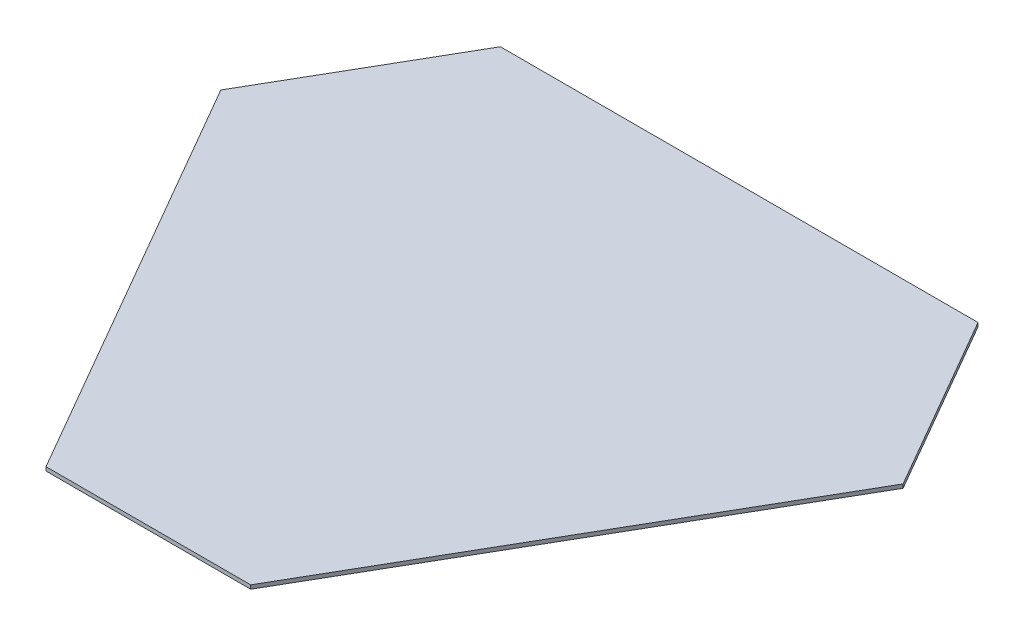
ISO-10303-21;
HEADER;
FILE_DESCRIPTION(('STEP AP214'),'2;1');
FILE_NAME('part.step','',(''),(''),'','','');
FILE_SCHEMA(('AUTOMOTIVE_DESIGN { 1 0 10303 214 1 1 1 1 }'));
ENDSEC;
DATA;
#1=APPLICATION_CONTEXT('core data for automotive mechanical design processes');
#2=APPLICATION_PROTOCOL_DEFINITION('international standard','automotive_design',2000,#1);
#3=PRODUCT_CONTEXT('',#1,'mechanical');
#4=PRODUCT('Part','Part','',(#3));
#5=PRODUCT_RELATED_PRODUCT_CATEGORY('part','',(#4));
#6=PRODUCT_DEFINITION_FORMATION('','',#4);
#7=PRODUCT_DEFINITION_CONTEXT('part definition',#1,'design');
#8=PRODUCT_DEFINITION('design','',#6,#7);
#9=PRODUCT_DEFINITION_SHAPE('','',#8);
#10=(LENGTH_UNIT() NAMED_UNIT(*) SI_UNIT(.MILLI.,.METRE.));
#11=(NAMED_UNIT(*) PLANE_ANGLE_UNIT() SI_UNIT($,.RADIAN.));
#12=(NAMED_UNIT(*) SI_UNIT($,.STERADIAN.) SOLID_ANGLE_UNIT());
#13=UNCERTAINTY_MEASURE_WITH_UNIT(LENGTH_MEASURE(1.E-05),#10,'distance_accuracy_value','');
#14=(GEOMETRIC_REPRESENTATION_CONTEXT(3) GLOBAL_UNCERTAINTY_ASSIGNED_CONTEXT((#13)) GLOBAL_UNIT_ASSIGNED_CONTEXT((#10,
#11,#12)) REPRESENTATION_CONTEXT('',''));
#15=CARTESIAN_POINT('',(0.,0.,0.));
#16=DIRECTION('',(0.,0.,1.));
#17=DIRECTION('',(1.,0.,0.));
#18=AXIS2_PLACEMENT_3D('',#15,#16,#17);
#19=CARTESIAN_POINT('',(125.,1.4,-28.8675134594812));
#20=DIRECTION('',(-0.866025403784438,0.,0.500000000000002));
#21=DIRECTION('',(0.500000000000001,0.,0.866025403784438));
#22=AXIS2_PLACEMENT_3D('',#19,#20,#21);
#23=PLANE('',#22);
#24=DIRECTION('',(-0.500000000000001,0.,-0.866025403784438));
#25=VECTOR('',#24,1.);
#26=CARTESIAN_POINT('',(125.,0.,-28.8675134594812));
#27=LINE('',#26,#25);
#28=CARTESIAN_POINT('',(125.,0.,-28.8675134594812));
#29=VERTEX_POINT('',#28);
#30=CARTESIAN_POINT('',(87.5,0.,-93.819418743314));
#31=VERTEX_POINT('',#30);
#32=EDGE_CURVE('E132',#29,#31,#27,.T.);
#33=ORIENTED_EDGE('',*,*,#32,.T.);
#34=DIRECTION('',(0.,-1.,0.));
#35=VECTOR('',#34,1.);
#36=CARTESIAN_POINT('',(87.5,1.4,-93.819418743314));
#37=LINE('',#36,#35);
#38=CARTESIAN_POINT('',(87.5,1.4,-93.819418743314));
#39=VERTEX_POINT('',#38);
#40=EDGE_CURVE('E11',#39,#31,#37,.T.);
#41=ORIENTED_EDGE('',*,*,#40,.F.);
#42=DIRECTION('',(-0.500000000000001,0.,-0.866025403784438));
#43=VECTOR('',#42,1.);
#44=CARTESIAN_POINT('',(125.,1.4,-28.8675134594812));
#45=LINE('',#44,#43);
#46=CARTESIAN_POINT('',(125.,1.4,-28.8675134594812));
#47=VERTEX_POINT('',#46);
#48=EDGE_CURVE('E148',#47,#39,#45,.T.);
#49=ORIENTED_EDGE('',*,*,#48,.F.);
#50=DIRECTION('',(0.,-1.,0.));
#51=VECTOR('',#50,1.);
#52=CARTESIAN_POINT('',(125.,1.4,-28.8675134594812));
#53=LINE('',#52,#51);
#54=EDGE_CURVE('E128',#47,#29,#53,.T.);
#55=ORIENTED_EDGE('',*,*,#54,.T.);
#56=EDGE_LOOP('',(#33,#41,#49,#55));
#57=FACE_BOUND('',#56,.T.);
#58=ADVANCED_FACE('F43',(#57),#23,.F.);
#59=CARTESIAN_POINT('',(87.5,1.4,-93.819418743314));
#60=DIRECTION('',(0.,0.,1.));
#61=DIRECTION('',(1.,0.,0.));
#62=AXIS2_PLACEMENT_3D('',#59,#60,#61);
#63=PLANE('',#62);
#64=DIRECTION('',(-1.,0.,0.));
#65=VECTOR('',#64,1.);
#66=CARTESIAN_POINT('',(87.5,0.,-93.819418743314));
#67=LINE('',#66,#65);
#68=CARTESIAN_POINT('',(-87.5,0.,-93.8194187433141));
#69=VERTEX_POINT('',#68);
#70=EDGE_CURVE('E136',#31,#69,#67,.T.);
#71=ORIENTED_EDGE('',*,*,#70,.T.);
#72=DIRECTION('',(0.,-1.,0.));
#73=VECTOR('',#72,1.);
#74=CARTESIAN_POINT('',(-87.5,1.4,-93.8194187433141));
#75=LINE('',#74,#73);
#76=CARTESIAN_POINT('',(-87.5,1.4,-93.8194187433141));
#77=VERTEX_POINT('',#76);
#78=EDGE_CURVE('E52',#77,#69,#75,.T.);
#79=ORIENTED_EDGE('',*,*,#78,.F.);
#80=DIRECTION('',(-1.,0.,0.));
#81=VECTOR('',#80,1.);
#82=CARTESIAN_POINT('',(87.5,1.4,-93.819418743314));
#83=LINE('',#82,#81);
#84=EDGE_CURVE('E97',#39,#77,#83,.T.);
#85=ORIENTED_EDGE('',*,*,#84,.F.);
#86=ORIENTED_EDGE('',*,*,#40,.T.);
#87=EDGE_LOOP('',(#71,#79,#85,#86));
#88=FACE_BOUND('',#87,.T.);
#89=ADVANCED_FACE('F176',(#88),#63,.F.);
#90=CARTESIAN_POINT('',(-87.5,1.4,-93.8194187433141));
#91=DIRECTION('',(0.866025403784438,0.,0.500000000000002));
#92=DIRECTION('',(0.500000000000001,0.,-0.866025403784438));
#93=AXIS2_PLACEMENT_3D('',#90,#91,#92);
#94=PLANE('',#93);
#95=DIRECTION('',(-0.500000000000001,0.,0.866025403784438));
#96=VECTOR('',#95,1.);
#97=CARTESIAN_POINT('',(-87.5,0.,-93.8194187433141));
#98=LINE('',#97,#96);
#99=CARTESIAN_POINT('',(-125.,0.,-28.8675134594812));
#100=VERTEX_POINT('',#99);
#101=EDGE_CURVE('E139',#69,#100,#98,.T.);
#102=ORIENTED_EDGE('',*,*,#101,.T.);
#103=DIRECTION('',(0.,-1.,0.));
#104=VECTOR('',#103,1.);
#105=CARTESIAN_POINT('',(-125.,1.4,-28.8675134594812));
#106=LINE('',#105,#104);
#107=CARTESIAN_POINT('',(-125.,1.4,-28.8675134594812));
#108=VERTEX_POINT('',#107);
#109=EDGE_CURVE('E121',#108,#100,#106,.T.);
#110=ORIENTED_EDGE('',*,*,#109,.F.);
#111=DIRECTION('',(-0.500000000000001,0.,0.866025403784438));
#112=VECTOR('',#111,1.);
#113=CARTESIAN_POINT('',(-87.5,1.4,-93.8194187433141));
#114=LINE('',#113,#112);
#115=EDGE_CURVE('E110',#77,#108,#114,.T.);
#116=ORIENTED_EDGE('',*,*,#115,.F.);
#117=ORIENTED_EDGE('',*,*,#78,.T.);
#118=EDGE_LOOP('',(#102,#110,#116,#117));
#119=FACE_BOUND('',#118,.T.);
#120=ADVANCED_FACE('F158',(#119),#94,.F.);
#121=CARTESIAN_POINT('',(-125.,1.4,-28.8675134594812));
#122=DIRECTION('',(0.866025403784438,0.,-0.5));
#123=DIRECTION('',(-0.5,0.,-0.866025403784438));
#124=AXIS2_PLACEMENT_3D('',#121,#122,#123);
#125=PLANE('',#124);
#126=DIRECTION('',(0.5,0.,0.866025403784438));
#127=VECTOR('',#126,1.);
#128=CARTESIAN_POINT('',(-125.,0.,-28.8675134594812));
#129=LINE('',#128,#127);
#130=CARTESIAN_POINT('',(-37.5,0.,122.686932202795));
#131=VERTEX_POINT('',#130);
#132=EDGE_CURVE('E119',#100,#131,#129,.T.);
#133=ORIENTED_EDGE('',*,*,#132,.T.);
#134=DIRECTION('',(0.,-1.,0.));
#135=VECTOR('',#134,1.);
#136=CARTESIAN_POINT('',(-37.5,1.4,122.686932202795));
#137=LINE('',#136,#135);
#138=CARTESIAN_POINT('',(-37.5,1.4,122.686932202795));
#139=VERTEX_POINT('',#138);
#140=EDGE_CURVE('E116',#139,#131,#137,.T.);
#141=ORIENTED_EDGE('',*,*,#140,.F.);
#142=DIRECTION('',(0.5,0.,0.866025403784438));
#143=VECTOR('',#142,1.);
#144=CARTESIAN_POINT('',(-125.,1.4,-28.8675134594812));
#145=LINE('',#144,#143);
#146=EDGE_CURVE('E104',#108,#139,#145,.T.);
#147=ORIENTED_EDGE('',*,*,#146,.F.);
#148=ORIENTED_EDGE('',*,*,#109,.T.);
#149=EDGE_LOOP('',(#133,#141,#147,#148));
#150=FACE_BOUND('',#149,.T.);
#151=ADVANCED_FACE('F117',(#150),#125,.F.);
#152=CARTESIAN_POINT('',(-37.5,1.4,122.686932202795));
#153=DIRECTION('',(0.,0.,-1.));
#154=DIRECTION('',(-1.,0.,0.));
#155=AXIS2_PLACEMENT_3D('',#152,#153,#154);
#156=PLANE('',#155);
#157=DIRECTION('',(1.,0.,0.));
#158=VECTOR('',#157,1.);
#159=CARTESIAN_POINT('',(-37.5,0.,122.686932202795));
#160=LINE('',#159,#158);
#161=CARTESIAN_POINT('',(37.5,0.,122.686932202795));
#162=VERTEX_POINT('',#161);
#163=EDGE_CURVE('E83',#131,#162,#160,.T.);
#164=ORIENTED_EDGE('',*,*,#163,.T.);
#165=DIRECTION('',(0.,-1.,0.));
#166=VECTOR('',#165,1.);
#167=CARTESIAN_POINT('',(37.5,1.4,122.686932202795));
#168=LINE('',#167,#166);
#169=CARTESIAN_POINT('',(37.5,1.4,122.686932202795));
#170=VERTEX_POINT('',#169);
#171=EDGE_CURVE('E122',#170,#162,#168,.T.);
#172=ORIENTED_EDGE('',*,*,#171,.F.);
#173=DIRECTION('',(1.,0.,0.));
#174=VECTOR('',#173,1.);
#175=CARTESIAN_POINT('',(-37.5,1.4,122.686932202795));
#176=LINE('',#175,#174);
#177=EDGE_CURVE('E108',#139,#170,#176,.T.);
#178=ORIENTED_EDGE('',*,*,#177,.F.);
#179=ORIENTED_EDGE('',*,*,#140,.T.);
#180=EDGE_LOOP('',(#164,#172,#178,#179));
#181=FACE_BOUND('',#180,.T.);
#182=ADVANCED_FACE('F124',(#181),#156,.F.);
#183=CARTESIAN_POINT('',(37.5,1.4,122.686932202795));
#184=DIRECTION('',(-0.866025403784438,0.,-0.500000000000001));
#185=DIRECTION('',(-0.500000000000001,0.,0.866025403784438));
#186=AXIS2_PLACEMENT_3D('',#183,#184,#185);
#187=PLANE('',#186);
#188=DIRECTION('',(0.500000000000001,0.,-0.866025403784438));
#189=VECTOR('',#188,1.);
#190=CARTESIAN_POINT('',(37.5,0.,122.686932202795));
#191=LINE('',#190,#189);
#192=EDGE_CURVE('E89',#162,#29,#191,.T.);
#193=ORIENTED_EDGE('',*,*,#192,.T.);
#194=ORIENTED_EDGE('',*,*,#54,.F.);
#195=DIRECTION('',(0.500000000000001,0.,-0.866025403784438));
#196=VECTOR('',#195,1.);
#197=CARTESIAN_POINT('',(37.5,1.4,122.686932202795));
#198=LINE('',#197,#196);
#199=EDGE_CURVE('E60',#170,#47,#198,.T.);
#200=ORIENTED_EDGE('',*,*,#199,.F.);
#201=ORIENTED_EDGE('',*,*,#171,.T.);
#202=EDGE_LOOP('',(#193,#194,#200,#201));
#203=FACE_BOUND('',#202,.T.);
#204=ADVANCED_FACE('F165',(#203),#187,.F.);
#205=CARTESIAN_POINT('',(0.,1.4,0.));
#206=DIRECTION('',(0.,1.,0.));
#207=DIRECTION('',(0.,0.,1.));
#208=AXIS2_PLACEMENT_3D('',#205,#206,#207);
#209=PLANE('',#208);
#210=ORIENTED_EDGE('',*,*,#48,.T.);
#211=ORIENTED_EDGE('',*,*,#84,.T.);
#212=ORIENTED_EDGE('',*,*,#115,.T.);
#213=ORIENTED_EDGE('',*,*,#146,.T.);
#214=ORIENTED_EDGE('',*,*,#177,.T.);
#215=ORIENTED_EDGE('',*,*,#199,.T.);
#216=EDGE_LOOP('',(#210,#211,#212,#213,#214,#215));
#217=FACE_BOUND('',#216,.T.);
#218=ADVANCED_FACE('F106',(#217),#209,.T.);
#219=CARTESIAN_POINT('',(0.,0.,0.));
#220=DIRECTION('',(0.,1.,0.));
#221=DIRECTION('',(0.,0.,1.));
#222=AXIS2_PLACEMENT_3D('',#219,#220,#221);
#223=PLANE('',#222);
#224=ORIENTED_EDGE('',*,*,#32,.F.);
#225=ORIENTED_EDGE('',*,*,#192,.F.);
#226=ORIENTED_EDGE('',*,*,#163,.F.);
#227=ORIENTED_EDGE('',*,*,#132,.F.);
#228=ORIENTED_EDGE('',*,*,#101,.F.);
#229=ORIENTED_EDGE('',*,*,#70,.F.);
#230=EDGE_LOOP('',(#224,#225,#226,#227,#228,#229));
#231=FACE_BOUND('',#230,.T.);
#232=ADVANCED_FACE('F161',(#231),#223,.F.);
#233=CLOSED_SHELL('',(#58,#89,#120,#151,#182,#204,#218,#232));
#234=MANIFOLD_SOLID_BREP('B2',#233);
#235=ADVANCED_BREP_SHAPE_REPRESENTATION('',(#18,#234),#14);
#236=SHAPE_DEFINITION_REPRESENTATION(#9,#235);
ENDSEC;
END-ISO-10303-21;
